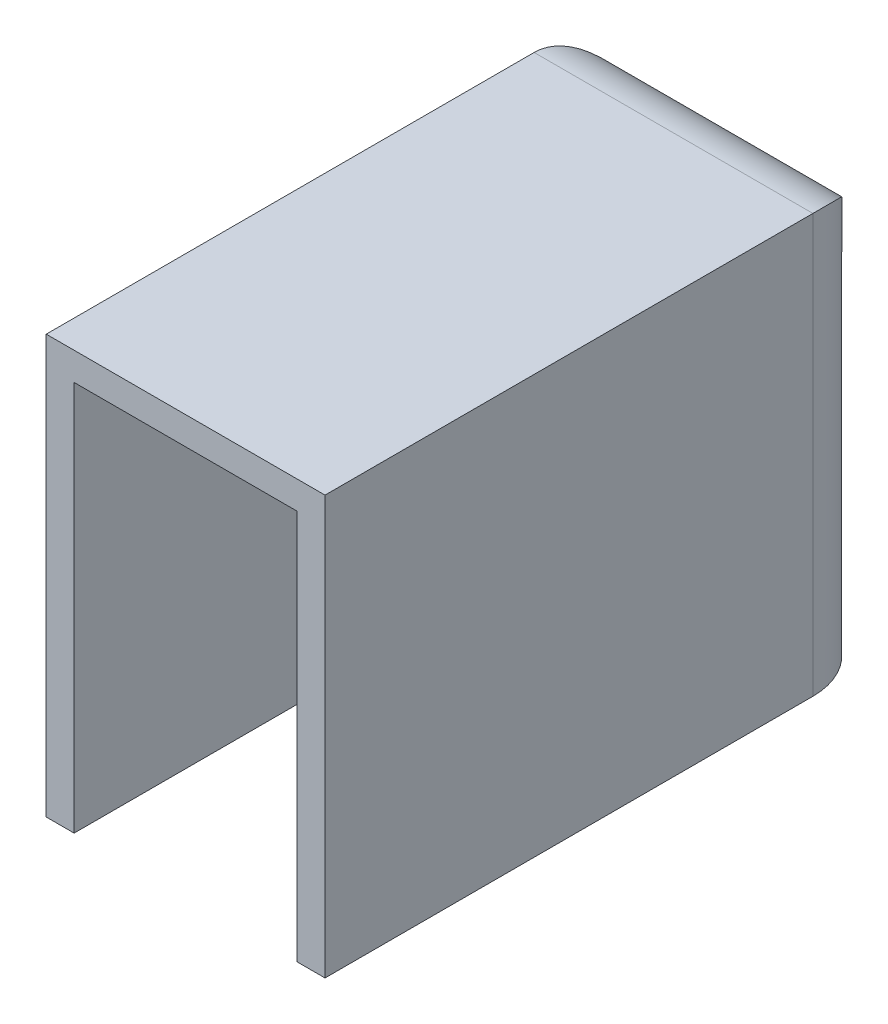
ISO-10303-21;
HEADER;
FILE_DESCRIPTION(('STEP AP214'),'2;1');
FILE_NAME('part.step','',(''),(''),'','','');
FILE_SCHEMA(('AUTOMOTIVE_DESIGN { 1 0 10303 214 1 1 1 1 }'));
ENDSEC;
DATA;
#1=APPLICATION_CONTEXT('core data for automotive mechanical design processes');
#2=APPLICATION_PROTOCOL_DEFINITION('international standard','automotive_design',2000,#1);
#3=PRODUCT_CONTEXT('',#1,'mechanical');
#4=PRODUCT('Part','Part','',(#3));
#5=PRODUCT_RELATED_PRODUCT_CATEGORY('part','',(#4));
#6=PRODUCT_DEFINITION_FORMATION('','',#4);
#7=PRODUCT_DEFINITION_CONTEXT('part definition',#1,'design');
#8=PRODUCT_DEFINITION('design','',#6,#7);
#9=PRODUCT_DEFINITION_SHAPE('','',#8);
#10=(LENGTH_UNIT() NAMED_UNIT(*) SI_UNIT(.MILLI.,.METRE.));
#11=(NAMED_UNIT(*) PLANE_ANGLE_UNIT() SI_UNIT($,.RADIAN.));
#12=(NAMED_UNIT(*) SI_UNIT($,.STERADIAN.) SOLID_ANGLE_UNIT());
#13=UNCERTAINTY_MEASURE_WITH_UNIT(LENGTH_MEASURE(1.E-05),#10,'distance_accuracy_value','');
#14=(GEOMETRIC_REPRESENTATION_CONTEXT(3) GLOBAL_UNCERTAINTY_ASSIGNED_CONTEXT((#13)) GLOBAL_UNIT_ASSIGNED_CONTEXT((#10,
#11,#12)) REPRESENTATION_CONTEXT('',''));
#15=CARTESIAN_POINT('',(0.,0.,0.));
#16=DIRECTION('',(0.,0.,1.));
#17=DIRECTION('',(1.,0.,0.));
#18=AXIS2_PLACEMENT_3D('',#15,#16,#17);
#19=CARTESIAN_POINT('',(0.,0.,2.));
#20=DIRECTION('',(0.,0.,-1.));
#21=DIRECTION('',(-1.,0.,0.));
#22=AXIS2_PLACEMENT_3D('',#19,#20,#21);
#23=PLANE('',#22);
#24=DIRECTION('',(0.,1.,0.));
#25=VECTOR('',#24,1.);
#26=CARTESIAN_POINT('',(8.,0.,2.));
#27=LINE('',#26,#25);
#28=CARTESIAN_POINT('',(8.,-15.,2.));
#29=VERTEX_POINT('',#28);
#30=CARTESIAN_POINT('',(8.,13.,2.));
#31=VERTEX_POINT('',#30);
#32=EDGE_CURVE('E165',#29,#31,#27,.T.);
#33=ORIENTED_EDGE('',*,*,#32,.T.);
#34=DIRECTION('',(-1.,0.,0.));
#35=VECTOR('',#34,1.);
#36=CARTESIAN_POINT('',(0.,13.,2.));
#37=LINE('',#36,#35);
#38=CARTESIAN_POINT('',(-8.,13.,2.));
#39=VERTEX_POINT('',#38);
#40=EDGE_CURVE('E168',#31,#39,#37,.T.);
#41=ORIENTED_EDGE('',*,*,#40,.T.);
#42=DIRECTION('',(0.,-1.,0.));
#43=VECTOR('',#42,1.);
#44=CARTESIAN_POINT('',(-8.,0.,2.));
#45=LINE('',#44,#43);
#46=CARTESIAN_POINT('',(-8.,-15.,2.));
#47=VERTEX_POINT('',#46);
#48=EDGE_CURVE('E175',#39,#47,#45,.T.);
#49=ORIENTED_EDGE('',*,*,#48,.T.);
#50=DIRECTION('',(1.,0.,0.));
#51=VECTOR('',#50,1.);
#52=CARTESIAN_POINT('',(0.,-15.,2.));
#53=LINE('',#52,#51);
#54=EDGE_CURVE('E180',#47,#29,#53,.T.);
#55=ORIENTED_EDGE('',*,*,#54,.T.);
#56=EDGE_LOOP('',(#33,#41,#49,#55));
#57=FACE_BOUND('',#56,.T.);
#58=DIRECTION('',(0.,-1.,0.));
#59=VECTOR('',#58,1.);
#60=CARTESIAN_POINT('',(-6.,-10.,2.));
#61=LINE('',#60,#59);
#62=CARTESIAN_POINT('',(-6.,-10.,2.));
#63=VERTEX_POINT('',#62);
#64=CARTESIAN_POINT('',(-6.,-12.,2.));
#65=VERTEX_POINT('',#64);
#66=EDGE_CURVE('E157',#63,#65,#61,.T.);
#67=ORIENTED_EDGE('',*,*,#66,.F.);
#68=DIRECTION('',(-1.,0.,0.));
#69=VECTOR('',#68,1.);
#70=CARTESIAN_POINT('',(6.,-10.,2.));
#71=LINE('',#70,#69);
#72=CARTESIAN_POINT('',(6.,-10.,2.));
#73=VERTEX_POINT('',#72);
#74=EDGE_CURVE('E154',#73,#63,#71,.T.);
#75=ORIENTED_EDGE('',*,*,#74,.F.);
#76=DIRECTION('',(0.,1.,0.));
#77=VECTOR('',#76,1.);
#78=CARTESIAN_POINT('',(6.,-10.,2.));
#79=LINE('',#78,#77);
#80=CARTESIAN_POINT('',(6.,-12.,2.));
#81=VERTEX_POINT('',#80);
#82=EDGE_CURVE('E57',#81,#73,#79,.T.);
#83=ORIENTED_EDGE('',*,*,#82,.F.);
#84=DIRECTION('',(1.,0.,0.));
#85=VECTOR('',#84,1.);
#86=CARTESIAN_POINT('',(6.,-12.,2.));
#87=LINE('',#86,#85);
#88=EDGE_CURVE('E52',#65,#81,#87,.T.);
#89=ORIENTED_EDGE('',*,*,#88,.F.);
#90=EDGE_LOOP('',(#67,#75,#83,#89));
#91=FACE_BOUND('',#90,.T.);
#92=ADVANCED_FACE('F35',(#57,#91),#23,.F.);
#93=CARTESIAN_POINT('',(0.,0.,40.));
#94=DIRECTION('',(0.,0.,-1.));
#95=DIRECTION('',(-1.,0.,0.));
#96=AXIS2_PLACEMENT_3D('',#93,#94,#95);
#97=PLANE('',#96);
#98=DIRECTION('',(0.,1.,0.));
#99=VECTOR('',#98,1.);
#100=CARTESIAN_POINT('',(8.,0.,40.));
#101=LINE('',#100,#99);
#102=CARTESIAN_POINT('',(8.,-15.,40.));
#103=VERTEX_POINT('',#102);
#104=CARTESIAN_POINT('',(8.,13.,40.));
#105=VERTEX_POINT('',#104);
#106=EDGE_CURVE('E181',#103,#105,#101,.T.);
#107=ORIENTED_EDGE('',*,*,#106,.F.);
#108=DIRECTION('',(1.,0.,0.));
#109=VECTOR('',#108,1.);
#110=CARTESIAN_POINT('',(-10.,-15.,40.));
#111=LINE('',#110,#109);
#112=CARTESIAN_POINT('',(10.,-15.,40.));
#113=VERTEX_POINT('',#112);
#114=EDGE_CURVE('E201',#103,#113,#111,.T.);
#115=ORIENTED_EDGE('',*,*,#114,.T.);
#116=DIRECTION('',(0.,1.,0.));
#117=VECTOR('',#116,1.);
#118=CARTESIAN_POINT('',(10.,-15.,40.));
#119=LINE('',#118,#117);
#120=CARTESIAN_POINT('',(10.,15.,40.));
#121=VERTEX_POINT('',#120);
#122=EDGE_CURVE('E194',#113,#121,#119,.T.);
#123=ORIENTED_EDGE('',*,*,#122,.T.);
#124=DIRECTION('',(-1.,0.,0.));
#125=VECTOR('',#124,1.);
#126=CARTESIAN_POINT('',(-10.,15.,40.));
#127=LINE('',#126,#125);
#128=CARTESIAN_POINT('',(-10.,15.,40.));
#129=VERTEX_POINT('',#128);
#130=EDGE_CURVE('E197',#121,#129,#127,.T.);
#131=ORIENTED_EDGE('',*,*,#130,.T.);
#132=DIRECTION('',(0.,-1.,0.));
#133=VECTOR('',#132,1.);
#134=CARTESIAN_POINT('',(-10.,-15.,40.));
#135=LINE('',#134,#133);
#136=CARTESIAN_POINT('',(-10.,-15.,40.));
#137=VERTEX_POINT('',#136);
#138=EDGE_CURVE('E199',#129,#137,#135,.T.);
#139=ORIENTED_EDGE('',*,*,#138,.T.);
#140=CARTESIAN_POINT('',(-8.,-15.,40.));
#141=VERTEX_POINT('',#140);
#142=EDGE_CURVE('E202',#137,#141,#111,.T.);
#143=ORIENTED_EDGE('',*,*,#142,.T.);
#144=DIRECTION('',(0.,-1.,0.));
#145=VECTOR('',#144,1.);
#146=CARTESIAN_POINT('',(-8.,0.,40.));
#147=LINE('',#146,#145);
#148=CARTESIAN_POINT('',(-8.,13.,40.));
#149=VERTEX_POINT('',#148);
#150=EDGE_CURVE('E186',#149,#141,#147,.T.);
#151=ORIENTED_EDGE('',*,*,#150,.F.);
#152=DIRECTION('',(-1.,0.,0.));
#153=VECTOR('',#152,1.);
#154=CARTESIAN_POINT('',(0.,13.,40.));
#155=LINE('',#154,#153);
#156=EDGE_CURVE('E183',#105,#149,#155,.T.);
#157=ORIENTED_EDGE('',*,*,#156,.F.);
#158=EDGE_LOOP('',(#107,#115,#123,#131,#139,#143,#151,#157));
#159=FACE_BOUND('',#158,.T.);
#160=ADVANCED_FACE('F268',(#159),#97,.F.);
#161=CARTESIAN_POINT('',(10.,-15.,40.));
#162=DIRECTION('',(-1.,0.,0.));
#163=DIRECTION('',(0.,0.,1.));
#164=AXIS2_PLACEMENT_3D('',#161,#162,#163);
#165=PLANE('',#164);
#166=DIRECTION('',(0.,0.,-1.));
#167=VECTOR('',#166,1.);
#168=CARTESIAN_POINT('',(10.,-15.,40.));
#169=LINE('',#168,#167);
#170=CARTESIAN_POINT('',(10.,-15.,5.));
#171=VERTEX_POINT('',#170);
#172=EDGE_CURVE('E205',#113,#171,#169,.T.);
#173=ORIENTED_EDGE('',*,*,#172,.T.);
#174=DIRECTION('',(0.,1.,0.));
#175=VECTOR('',#174,1.);
#176=CARTESIAN_POINT('',(10.,15.,5.));
#177=LINE('',#176,#175);
#178=CARTESIAN_POINT('',(10.,15.,5.));
#179=VERTEX_POINT('',#178);
#180=EDGE_CURVE('E11',#171,#179,#177,.T.);
#181=ORIENTED_EDGE('',*,*,#180,.T.);
#182=DIRECTION('',(0.,0.,-1.));
#183=VECTOR('',#182,1.);
#184=CARTESIAN_POINT('',(10.,15.,40.));
#185=LINE('',#184,#183);
#186=EDGE_CURVE('E216',#121,#179,#185,.T.);
#187=ORIENTED_EDGE('',*,*,#186,.F.);
#188=ORIENTED_EDGE('',*,*,#122,.F.);
#189=EDGE_LOOP('',(#173,#181,#187,#188));
#190=FACE_BOUND('',#189,.T.);
#191=ADVANCED_FACE('F265',(#190),#165,.F.);
#192=CARTESIAN_POINT('',(-10.,15.,40.));
#193=DIRECTION('',(0.,-1.,0.));
#194=DIRECTION('',(0.,0.,-1.));
#195=AXIS2_PLACEMENT_3D('',#192,#193,#194);
#196=PLANE('',#195);
#197=ORIENTED_EDGE('',*,*,#186,.T.);
#198=DIRECTION('',(-1.,0.,0.));
#199=VECTOR('',#198,1.);
#200=CARTESIAN_POINT('',(-10.,15.,5.));
#201=LINE('',#200,#199);
#202=CARTESIAN_POINT('',(-10.,15.,5.));
#203=VERTEX_POINT('',#202);
#204=EDGE_CURVE('E44',#179,#203,#201,.T.);
#205=ORIENTED_EDGE('',*,*,#204,.T.);
#206=DIRECTION('',(0.,0.,-1.));
#207=VECTOR('',#206,1.);
#208=CARTESIAN_POINT('',(-10.,15.,40.));
#209=LINE('',#208,#207);
#210=EDGE_CURVE('E213',#129,#203,#209,.T.);
#211=ORIENTED_EDGE('',*,*,#210,.F.);
#212=ORIENTED_EDGE('',*,*,#130,.F.);
#213=EDGE_LOOP('',(#197,#205,#211,#212));
#214=FACE_BOUND('',#213,.T.);
#215=ADVANCED_FACE('F235',(#214),#196,.F.);
#216=CARTESIAN_POINT('',(-10.,-15.,40.));
#217=DIRECTION('',(1.,0.,0.));
#218=DIRECTION('',(0.,0.,-1.));
#219=AXIS2_PLACEMENT_3D('',#216,#217,#218);
#220=PLANE('',#219);
#221=ORIENTED_EDGE('',*,*,#210,.T.);
#222=DIRECTION('',(0.,-1.,0.));
#223=VECTOR('',#222,1.);
#224=CARTESIAN_POINT('',(-10.,-15.,5.));
#225=LINE('',#224,#223);
#226=CARTESIAN_POINT('',(-10.,-15.,5.));
#227=VERTEX_POINT('',#226);
#228=EDGE_CURVE('E219',#203,#227,#225,.T.);
#229=ORIENTED_EDGE('',*,*,#228,.T.);
#230=DIRECTION('',(0.,0.,-1.));
#231=VECTOR('',#230,1.);
#232=CARTESIAN_POINT('',(-10.,-15.,40.));
#233=LINE('',#232,#231);
#234=EDGE_CURVE('E210',#137,#227,#233,.T.);
#235=ORIENTED_EDGE('',*,*,#234,.F.);
#236=ORIENTED_EDGE('',*,*,#138,.F.);
#237=EDGE_LOOP('',(#221,#229,#235,#236));
#238=FACE_BOUND('',#237,.T.);
#239=ADVANCED_FACE('F243',(#238),#220,.F.);
#240=CARTESIAN_POINT('',(-10.,-15.,40.));
#241=DIRECTION('',(0.,1.,0.));
#242=DIRECTION('',(0.,0.,1.));
#243=AXIS2_PLACEMENT_3D('',#240,#241,#242);
#244=PLANE('',#243);
#245=ORIENTED_EDGE('',*,*,#234,.T.);
#246=CARTESIAN_POINT('',(-5.,-15.,5.));
#247=DIRECTION('',(0.,1.,0.));
#248=DIRECTION('',(0.,0.,1.));
#249=AXIS2_PLACEMENT_3D('',#246,#247,#248);
#250=CIRCLE('',#249,5.);
#251=CARTESIAN_POINT('',(-5.,-15.,0.));
#252=VERTEX_POINT('',#251);
#253=EDGE_CURVE('E224',#227,#252,#250,.F.);
#254=ORIENTED_EDGE('',*,*,#253,.T.);
#255=DIRECTION('',(1.,0.,0.));
#256=VECTOR('',#255,1.);
#257=CARTESIAN_POINT('',(-10.,-15.,0.));
#258=LINE('',#257,#256);
#259=CARTESIAN_POINT('',(5.,-15.,0.));
#260=VERTEX_POINT('',#259);
#261=EDGE_CURVE('E172',#252,#260,#258,.T.);
#262=ORIENTED_EDGE('',*,*,#261,.T.);
#263=CARTESIAN_POINT('',(5.,-15.,5.));
#264=DIRECTION('',(0.,1.,0.));
#265=DIRECTION('',(0.,0.,1.));
#266=AXIS2_PLACEMENT_3D('',#263,#264,#265);
#267=CIRCLE('',#266,5.);
#268=EDGE_CURVE('E222',#260,#171,#267,.F.);
#269=ORIENTED_EDGE('',*,*,#268,.T.);
#270=ORIENTED_EDGE('',*,*,#172,.F.);
#271=ORIENTED_EDGE('',*,*,#114,.F.);
#272=DIRECTION('',(0.,0.,-1.));
#273=VECTOR('',#272,1.);
#274=CARTESIAN_POINT('',(8.,-15.,40.));
#275=LINE('',#274,#273);
#276=EDGE_CURVE('E188',#103,#29,#275,.T.);
#277=ORIENTED_EDGE('',*,*,#276,.T.);
#278=ORIENTED_EDGE('',*,*,#54,.F.);
#279=DIRECTION('',(0.,0.,-1.));
#280=VECTOR('',#279,1.);
#281=CARTESIAN_POINT('',(-8.,-15.,40.));
#282=LINE('',#281,#280);
#283=EDGE_CURVE('E178',#141,#47,#282,.T.);
#284=ORIENTED_EDGE('',*,*,#283,.F.);
#285=ORIENTED_EDGE('',*,*,#142,.F.);
#286=EDGE_LOOP('',(#245,#254,#262,#269,#270,#271,#277,#278,#284,#285));
#287=FACE_BOUND('',#286,.T.);
#288=ADVANCED_FACE('F253',(#287),#244,.F.);
#289=CARTESIAN_POINT('',(0.,0.,0.));
#290=DIRECTION('',(0.,0.,-1.));
#291=DIRECTION('',(-1.,0.,0.));
#292=AXIS2_PLACEMENT_3D('',#289,#290,#291);
#293=PLANE('',#292);
#294=ORIENTED_EDGE('',*,*,#261,.F.);
#295=DIRECTION('',(0.,-1.,0.));
#296=VECTOR('',#295,1.);
#297=CARTESIAN_POINT('',(-5.,15.,0.));
#298=LINE('',#297,#296);
#299=CARTESIAN_POINT('',(-5.,10.,0.));
#300=VERTEX_POINT('',#299);
#301=EDGE_CURVE('E230',#252,#300,#298,.F.);
#302=ORIENTED_EDGE('',*,*,#301,.T.);
#303=DIRECTION('',(-1.,0.,0.));
#304=VECTOR('',#303,1.);
#305=CARTESIAN_POINT('',(10.,10.,0.));
#306=LINE('',#305,#304);
#307=CARTESIAN_POINT('',(5.,10.,0.));
#308=VERTEX_POINT('',#307);
#309=EDGE_CURVE('E228',#300,#308,#306,.F.);
#310=ORIENTED_EDGE('',*,*,#309,.T.);
#311=DIRECTION('',(0.,1.,0.));
#312=VECTOR('',#311,1.);
#313=CARTESIAN_POINT('',(5.,-15.,0.));
#314=LINE('',#313,#312);
#315=EDGE_CURVE('E226',#308,#260,#314,.F.);
#316=ORIENTED_EDGE('',*,*,#315,.T.);
#317=EDGE_LOOP('',(#294,#302,#310,#316));
#318=FACE_BOUND('',#317,.T.);
#319=ADVANCED_FACE('F257',(#318),#293,.T.);
#320=CARTESIAN_POINT('',(8.,-15.,40.));
#321=DIRECTION('',(-1.,0.,0.));
#322=DIRECTION('',(0.,0.,1.));
#323=AXIS2_PLACEMENT_3D('',#320,#321,#322);
#324=PLANE('',#323);
#325=ORIENTED_EDGE('',*,*,#32,.F.);
#326=ORIENTED_EDGE('',*,*,#276,.F.);
#327=ORIENTED_EDGE('',*,*,#106,.T.);
#328=DIRECTION('',(0.,0.,-1.));
#329=VECTOR('',#328,1.);
#330=CARTESIAN_POINT('',(8.,13.,40.));
#331=LINE('',#330,#329);
#332=EDGE_CURVE('E169',#105,#31,#331,.T.);
#333=ORIENTED_EDGE('',*,*,#332,.T.);
#334=EDGE_LOOP('',(#325,#326,#327,#333));
#335=FACE_BOUND('',#334,.T.);
#336=ADVANCED_FACE('F274',(#335),#324,.T.);
#337=CARTESIAN_POINT('',(-10.,13.,40.));
#338=DIRECTION('',(0.,-1.,0.));
#339=DIRECTION('',(0.,0.,-1.));
#340=AXIS2_PLACEMENT_3D('',#337,#338,#339);
#341=PLANE('',#340);
#342=ORIENTED_EDGE('',*,*,#40,.F.);
#343=ORIENTED_EDGE('',*,*,#332,.F.);
#344=ORIENTED_EDGE('',*,*,#156,.T.);
#345=DIRECTION('',(0.,0.,-1.));
#346=VECTOR('',#345,1.);
#347=CARTESIAN_POINT('',(-8.,13.,40.));
#348=LINE('',#347,#346);
#349=EDGE_CURVE('E173',#149,#39,#348,.T.);
#350=ORIENTED_EDGE('',*,*,#349,.T.);
#351=EDGE_LOOP('',(#342,#343,#344,#350));
#352=FACE_BOUND('',#351,.T.);
#353=ADVANCED_FACE('F282',(#352),#341,.T.);
#354=CARTESIAN_POINT('',(-8.,-15.,40.));
#355=DIRECTION('',(1.,0.,0.));
#356=DIRECTION('',(0.,0.,-1.));
#357=AXIS2_PLACEMENT_3D('',#354,#355,#356);
#358=PLANE('',#357);
#359=ORIENTED_EDGE('',*,*,#48,.F.);
#360=ORIENTED_EDGE('',*,*,#349,.F.);
#361=ORIENTED_EDGE('',*,*,#150,.T.);
#362=ORIENTED_EDGE('',*,*,#283,.T.);
#363=EDGE_LOOP('',(#359,#360,#361,#362));
#364=FACE_BOUND('',#363,.T.);
#365=ADVANCED_FACE('F279',(#364),#358,.T.);
#366=CARTESIAN_POINT('',(5.,-15.,5.));
#367=DIRECTION('',(0.,-1.,0.));
#368=DIRECTION('',(0.,0.,-1.));
#369=AXIS2_PLACEMENT_3D('',#366,#367,#368);
#370=CYLINDRICAL_SURFACE('',#369,5.);
#371=ORIENTED_EDGE('',*,*,#268,.F.);
#372=ORIENTED_EDGE('',*,*,#315,.F.);
#373=CARTESIAN_POINT('',(5.,10.,5.));
#374=DIRECTION('',(0.707106781186547,-0.707106781186547,0.));
#375=DIRECTION('',(-0.707106781186547,-0.707106781186547,0.));
#376=AXIS2_PLACEMENT_3D('',#373,#374,#375);
#377=ELLIPSE('',#376,7.07106781186547,5.);
#378=EDGE_CURVE('E39',#179,#308,#377,.F.);
#379=ORIENTED_EDGE('',*,*,#378,.F.);
#380=ORIENTED_EDGE('',*,*,#180,.F.);
#381=EDGE_LOOP('',(#371,#372,#379,#380));
#382=FACE_BOUND('',#381,.T.);
#383=ADVANCED_FACE('F37',(#382),#370,.T.);
#384=CARTESIAN_POINT('',(-10.,10.,5.));
#385=DIRECTION('',(1.,0.,0.));
#386=DIRECTION('',(0.,0.,-1.));
#387=AXIS2_PLACEMENT_3D('',#384,#385,#386);
#388=CYLINDRICAL_SURFACE('',#387,5.);
#389=ORIENTED_EDGE('',*,*,#378,.T.);
#390=ORIENTED_EDGE('',*,*,#309,.F.);
#391=CARTESIAN_POINT('',(-5.,10.,5.));
#392=DIRECTION('',(0.707106781186547,0.707106781186547,0.));
#393=DIRECTION('',(0.707106781186547,-0.707106781186547,0.));
#394=AXIS2_PLACEMENT_3D('',#391,#392,#393);
#395=ELLIPSE('',#394,7.07106781186547,5.);
#396=EDGE_CURVE('E158',#203,#300,#395,.F.);
#397=ORIENTED_EDGE('',*,*,#396,.F.);
#398=ORIENTED_EDGE('',*,*,#204,.F.);
#399=EDGE_LOOP('',(#389,#390,#397,#398));
#400=FACE_BOUND('',#399,.T.);
#401=ADVANCED_FACE('F247',(#400),#388,.T.);
#402=CARTESIAN_POINT('',(-5.,-15.,5.));
#403=DIRECTION('',(0.,1.,0.));
#404=DIRECTION('',(0.,0.,1.));
#405=AXIS2_PLACEMENT_3D('',#402,#403,#404);
#406=CYLINDRICAL_SURFACE('',#405,5.);
#407=ORIENTED_EDGE('',*,*,#396,.T.);
#408=ORIENTED_EDGE('',*,*,#301,.F.);
#409=ORIENTED_EDGE('',*,*,#253,.F.);
#410=ORIENTED_EDGE('',*,*,#228,.F.);
#411=EDGE_LOOP('',(#407,#408,#409,#410));
#412=FACE_BOUND('',#411,.T.);
#413=ADVANCED_FACE('F250',(#412),#406,.T.);
#414=CARTESIAN_POINT('',(-6.,-10.,4.5));
#415=DIRECTION('',(1.,0.,0.));
#416=DIRECTION('',(0.,0.,-1.));
#417=AXIS2_PLACEMENT_3D('',#414,#415,#416);
#418=PLANE('',#417);
#419=ORIENTED_EDGE('',*,*,#66,.T.);
#420=DIRECTION('',(0.,0.,-1.));
#421=VECTOR('',#420,1.);
#422=CARTESIAN_POINT('',(-6.,-12.,4.5));
#423=LINE('',#422,#421);
#424=CARTESIAN_POINT('',(-6.,-12.,4.5));
#425=VERTEX_POINT('',#424);
#426=EDGE_CURVE('E138',#425,#65,#423,.T.);
#427=ORIENTED_EDGE('',*,*,#426,.F.);
#428=DIRECTION('',(0.,-1.,0.));
#429=VECTOR('',#428,1.);
#430=CARTESIAN_POINT('',(-6.,-10.,4.5));
#431=LINE('',#430,#429);
#432=CARTESIAN_POINT('',(-6.,-10.,4.5));
#433=VERTEX_POINT('',#432);
#434=EDGE_CURVE('E145',#433,#425,#431,.T.);
#435=ORIENTED_EDGE('',*,*,#434,.F.);
#436=DIRECTION('',(0.,0.,-1.));
#437=VECTOR('',#436,1.);
#438=CARTESIAN_POINT('',(-6.,-10.,4.5));
#439=LINE('',#438,#437);
#440=EDGE_CURVE('E443',#433,#63,#439,.T.);
#441=ORIENTED_EDGE('',*,*,#440,.T.);
#442=EDGE_LOOP('',(#419,#427,#435,#441));
#443=FACE_BOUND('',#442,.T.);
#444=ADVANCED_FACE('F156',(#443),#418,.F.);
#445=CARTESIAN_POINT('',(6.,-12.,4.5));
#446=DIRECTION('',(0.,1.,0.));
#447=DIRECTION('',(-1.,0.,0.));
#448=AXIS2_PLACEMENT_3D('',#445,#446,#447);
#449=PLANE('',#448);
#450=ORIENTED_EDGE('',*,*,#88,.T.);
#451=DIRECTION('',(0.,0.,-1.));
#452=VECTOR('',#451,1.);
#453=CARTESIAN_POINT('',(6.,-12.,4.5));
#454=LINE('',#453,#452);
#455=CARTESIAN_POINT('',(6.,-12.,4.5));
#456=VERTEX_POINT('',#455);
#457=EDGE_CURVE('E141',#456,#81,#454,.T.);
#458=ORIENTED_EDGE('',*,*,#457,.F.);
#459=DIRECTION('',(1.,0.,0.));
#460=VECTOR('',#459,1.);
#461=CARTESIAN_POINT('',(6.,-12.,4.5));
#462=LINE('',#461,#460);
#463=EDGE_CURVE('E134',#425,#456,#462,.T.);
#464=ORIENTED_EDGE('',*,*,#463,.F.);
#465=ORIENTED_EDGE('',*,*,#426,.T.);
#466=EDGE_LOOP('',(#450,#458,#464,#465));
#467=FACE_BOUND('',#466,.T.);
#468=ADVANCED_FACE('F136',(#467),#449,.F.);
#469=CARTESIAN_POINT('',(6.,-10.,4.5));
#470=DIRECTION('',(-1.,0.,0.));
#471=DIRECTION('',(0.,0.,1.));
#472=AXIS2_PLACEMENT_3D('',#469,#470,#471);
#473=PLANE('',#472);
#474=ORIENTED_EDGE('',*,*,#82,.T.);
#475=DIRECTION('',(0.,0.,-1.));
#476=VECTOR('',#475,1.);
#477=CARTESIAN_POINT('',(6.,-10.,4.5));
#478=LINE('',#477,#476);
#479=CARTESIAN_POINT('',(6.,-10.,4.5));
#480=VERTEX_POINT('',#479);
#481=EDGE_CURVE('E161',#480,#73,#478,.T.);
#482=ORIENTED_EDGE('',*,*,#481,.F.);
#483=DIRECTION('',(0.,1.,0.));
#484=VECTOR('',#483,1.);
#485=CARTESIAN_POINT('',(6.,-10.,4.5));
#486=LINE('',#485,#484);
#487=EDGE_CURVE('E144',#456,#480,#486,.T.);
#488=ORIENTED_EDGE('',*,*,#487,.F.);
#489=ORIENTED_EDGE('',*,*,#457,.T.);
#490=EDGE_LOOP('',(#474,#482,#488,#489));
#491=FACE_BOUND('',#490,.T.);
#492=ADVANCED_FACE('F409',(#491),#473,.F.);
#493=CARTESIAN_POINT('',(6.,-10.,4.5));
#494=DIRECTION('',(0.,-1.,0.));
#495=DIRECTION('',(1.,0.,0.));
#496=AXIS2_PLACEMENT_3D('',#493,#494,#495);
#497=PLANE('',#496);
#498=ORIENTED_EDGE('',*,*,#74,.T.);
#499=ORIENTED_EDGE('',*,*,#440,.F.);
#500=DIRECTION('',(-1.,0.,0.));
#501=VECTOR('',#500,1.);
#502=CARTESIAN_POINT('',(6.,-10.,4.5));
#503=LINE('',#502,#501);
#504=EDGE_CURVE('E150',#480,#433,#503,.T.);
#505=ORIENTED_EDGE('',*,*,#504,.F.);
#506=ORIENTED_EDGE('',*,*,#481,.T.);
#507=EDGE_LOOP('',(#498,#499,#505,#506));
#508=FACE_BOUND('',#507,.T.);
#509=ADVANCED_FACE('F417',(#508),#497,.F.);
#510=CARTESIAN_POINT('',(0.,0.,4.5));
#511=DIRECTION('',(0.,0.,-1.));
#512=DIRECTION('',(-1.,0.,0.));
#513=AXIS2_PLACEMENT_3D('',#510,#511,#512);
#514=PLANE('',#513);
#515=ORIENTED_EDGE('',*,*,#434,.T.);
#516=ORIENTED_EDGE('',*,*,#463,.T.);
#517=ORIENTED_EDGE('',*,*,#487,.T.);
#518=ORIENTED_EDGE('',*,*,#504,.T.);
#519=EDGE_LOOP('',(#515,#516,#517,#518));
#520=FACE_BOUND('',#519,.T.);
#521=ADVANCED_FACE('F148',(#520),#514,.F.);
#522=CLOSED_SHELL('',(#92,#160,#191,#215,#239,#288,#319,#336,#353,#365,#383,#401,#413,#444,#468,
#492,#509,#521));
#523=MANIFOLD_SOLID_BREP('B2',#522);
#524=ADVANCED_BREP_SHAPE_REPRESENTATION('',(#18,#523),#14);
#525=SHAPE_DEFINITION_REPRESENTATION(#9,#524);
ENDSEC;
END-ISO-10303-21;
